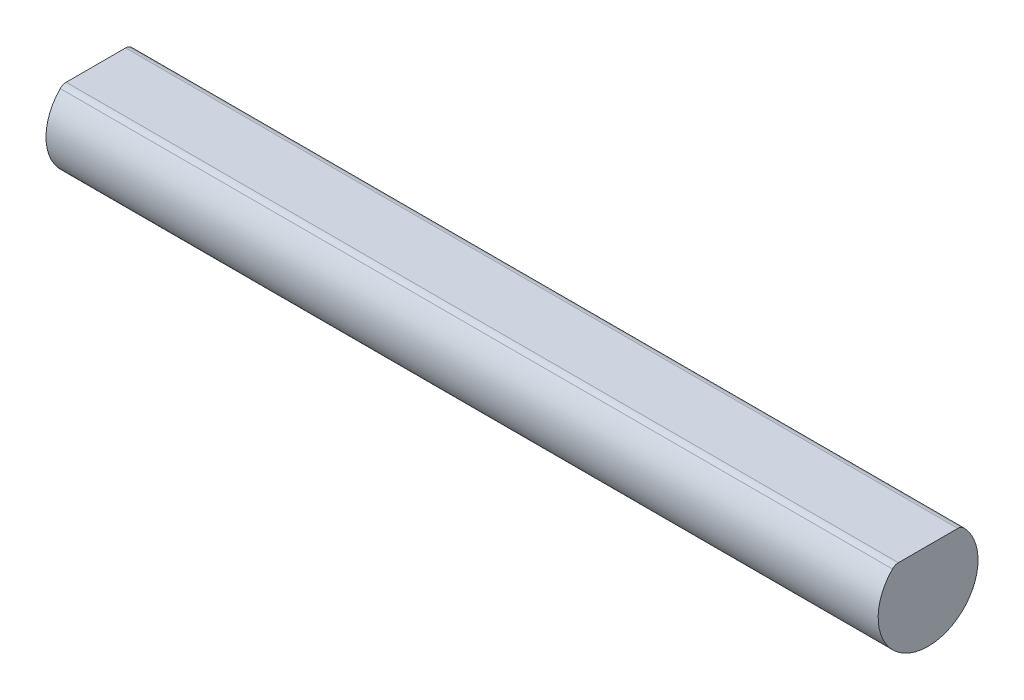
ISO-10303-21;
HEADER;
FILE_DESCRIPTION(('STEP AP214'),'2;1');
FILE_NAME('part.step','',(''),(''),'','','');
FILE_SCHEMA(('AUTOMOTIVE_DESIGN { 1 0 10303 214 1 1 1 1 }'));
ENDSEC;
DATA;
#1=APPLICATION_CONTEXT('core data for automotive mechanical design processes');
#2=APPLICATION_PROTOCOL_DEFINITION('international standard','automotive_design',2000,#1);
#3=PRODUCT_CONTEXT('',#1,'mechanical');
#4=PRODUCT('Part','Part','',(#3));
#5=PRODUCT_RELATED_PRODUCT_CATEGORY('part','',(#4));
#6=PRODUCT_DEFINITION_FORMATION('','',#4);
#7=PRODUCT_DEFINITION_CONTEXT('part definition',#1,'design');
#8=PRODUCT_DEFINITION('design','',#6,#7);
#9=PRODUCT_DEFINITION_SHAPE('','',#8);
#10=(LENGTH_UNIT() NAMED_UNIT(*) SI_UNIT(.MILLI.,.METRE.));
#11=(NAMED_UNIT(*) PLANE_ANGLE_UNIT() SI_UNIT($,.RADIAN.));
#12=(NAMED_UNIT(*) SI_UNIT($,.STERADIAN.) SOLID_ANGLE_UNIT());
#13=UNCERTAINTY_MEASURE_WITH_UNIT(LENGTH_MEASURE(1.E-05),#10,'distance_accuracy_value','');
#14=(GEOMETRIC_REPRESENTATION_CONTEXT(3) GLOBAL_UNCERTAINTY_ASSIGNED_CONTEXT((#13)) GLOBAL_UNIT_ASSIGNED_CONTEXT((#10,
#11,#12)) REPRESENTATION_CONTEXT('',''));
#15=CARTESIAN_POINT('',(0.,0.,0.));
#16=DIRECTION('',(0.,0.,1.));
#17=DIRECTION('',(1.,0.,0.));
#18=AXIS2_PLACEMENT_3D('',#15,#16,#17);
#19=CARTESIAN_POINT('',(100.,0.,0.));
#20=DIRECTION('',(-1.,0.,0.));
#21=DIRECTION('',(0.,0.,1.));
#22=AXIS2_PLACEMENT_3D('',#19,#20,#21);
#23=CYLINDRICAL_SURFACE('',#22,6.);
#24=CARTESIAN_POINT('',(0.,0.,0.));
#25=DIRECTION('',(1.,0.,0.));
#26=DIRECTION('',(0.,0.,-1.));
#27=AXIS2_PLACEMENT_3D('',#24,#25,#26);
#28=CIRCLE('',#27,6.);
#29=CARTESIAN_POINT('',(0.,4.2,4.28485705712571));
#30=VERTEX_POINT('',#29);
#31=CARTESIAN_POINT('',(0.,4.2,-4.28485705712571));
#32=VERTEX_POINT('',#31);
#33=EDGE_CURVE('E106',#30,#32,#28,.T.);
#34=ORIENTED_EDGE('',*,*,#33,.T.);
#35=DIRECTION('',(-1.,0.,0.));
#36=VECTOR('',#35,1.);
#37=CARTESIAN_POINT('',(100.,4.2,-4.28485705712571));
#38=LINE('',#37,#36);
#39=CARTESIAN_POINT('',(100.,4.2,-4.28485705712571));
#40=VERTEX_POINT('',#39);
#41=EDGE_CURVE('E98',#32,#40,#38,.F.);
#42=ORIENTED_EDGE('',*,*,#41,.T.);
#43=CARTESIAN_POINT('',(100.,0.,0.));
#44=DIRECTION('',(1.,0.,0.));
#45=DIRECTION('',(0.,0.,-1.));
#46=AXIS2_PLACEMENT_3D('',#43,#44,#45);
#47=CIRCLE('',#46,6.);
#48=CARTESIAN_POINT('',(100.,4.2,4.28485705712571));
#49=VERTEX_POINT('',#48);
#50=EDGE_CURVE('E90',#49,#40,#47,.T.);
#51=ORIENTED_EDGE('',*,*,#50,.F.);
#52=DIRECTION('',(-1.,0.,0.));
#53=VECTOR('',#52,1.);
#54=CARTESIAN_POINT('',(100.,4.2,4.28485705712571));
#55=LINE('',#54,#53);
#56=EDGE_CURVE('E103',#49,#30,#55,.T.);
#57=ORIENTED_EDGE('',*,*,#56,.T.);
#58=EDGE_LOOP('',(#34,#42,#51,#57));
#59=FACE_BOUND('',#58,.T.);
#60=ADVANCED_FACE('F45',(#59),#23,.T.);
#61=CARTESIAN_POINT('',(100.,0.,0.));
#62=DIRECTION('',(1.,0.,0.));
#63=DIRECTION('',(0.,0.,-1.));
#64=AXIS2_PLACEMENT_3D('',#61,#62,#63);
#65=PLANE('',#64);
#66=ORIENTED_EDGE('',*,*,#50,.T.);
#67=CARTESIAN_POINT('',(100.,3.5,-3.57071421427143));
#68=DIRECTION('',(1.,0.,0.));
#69=DIRECTION('',(0.,0.,-1.));
#70=AXIS2_PLACEMENT_3D('',#67,#68,#69);
#71=CIRCLE('',#70,1.);
#72=CARTESIAN_POINT('',(100.,4.5,-3.57071421427143));
#73=VERTEX_POINT('',#72);
#74=EDGE_CURVE('E97',#40,#73,#71,.T.);
#75=ORIENTED_EDGE('',*,*,#74,.T.);
#76=DIRECTION('',(0.,0.,-1.));
#77=VECTOR('',#76,1.);
#78=CARTESIAN_POINT('',(100.,4.5,0.));
#79=LINE('',#78,#77);
#80=CARTESIAN_POINT('',(100.,4.5,3.57071421427143));
#81=VERTEX_POINT('',#80);
#82=EDGE_CURVE('E91',#81,#73,#79,.T.);
#83=ORIENTED_EDGE('',*,*,#82,.F.);
#84=CARTESIAN_POINT('',(100.,3.5,3.57071421427143));
#85=DIRECTION('',(1.,0.,0.));
#86=DIRECTION('',(0.,0.,-1.));
#87=AXIS2_PLACEMENT_3D('',#84,#85,#86);
#88=CIRCLE('',#87,1.);
#89=EDGE_CURVE('E87',#81,#49,#88,.T.);
#90=ORIENTED_EDGE('',*,*,#89,.T.);
#91=EDGE_LOOP('',(#66,#75,#83,#90));
#92=FACE_BOUND('',#91,.T.);
#93=ADVANCED_FACE('F89',(#92),#65,.T.);
#94=CARTESIAN_POINT('',(0.,0.,0.));
#95=DIRECTION('',(1.,0.,0.));
#96=DIRECTION('',(0.,0.,-1.));
#97=AXIS2_PLACEMENT_3D('',#94,#95,#96);
#98=PLANE('',#97);
#99=DIRECTION('',(0.,0.,-1.));
#100=VECTOR('',#99,1.);
#101=CARTESIAN_POINT('',(0.,4.5,0.));
#102=LINE('',#101,#100);
#103=CARTESIAN_POINT('',(0.,4.5,3.57071421427143));
#104=VERTEX_POINT('',#103);
#105=CARTESIAN_POINT('',(0.,4.5,-3.57071421427143));
#106=VERTEX_POINT('',#105);
#107=EDGE_CURVE('E122',#104,#106,#102,.T.);
#108=ORIENTED_EDGE('',*,*,#107,.T.);
#109=CARTESIAN_POINT('',(0.,3.5,-3.57071421427143));
#110=DIRECTION('',(1.,0.,0.));
#111=DIRECTION('',(0.,0.,-1.));
#112=AXIS2_PLACEMENT_3D('',#109,#110,#111);
#113=CIRCLE('',#112,1.);
#114=EDGE_CURVE('E11',#106,#32,#113,.F.);
#115=ORIENTED_EDGE('',*,*,#114,.T.);
#116=ORIENTED_EDGE('',*,*,#33,.F.);
#117=CARTESIAN_POINT('',(0.,3.5,3.57071421427143));
#118=DIRECTION('',(1.,0.,0.));
#119=DIRECTION('',(0.,0.,-1.));
#120=AXIS2_PLACEMENT_3D('',#117,#118,#119);
#121=CIRCLE('',#120,1.);
#122=EDGE_CURVE('E54',#30,#104,#121,.F.);
#123=ORIENTED_EDGE('',*,*,#122,.T.);
#124=EDGE_LOOP('',(#108,#115,#116,#123));
#125=FACE_BOUND('',#124,.T.);
#126=ADVANCED_FACE('F131',(#125),#98,.F.);
#127=CARTESIAN_POINT('',(0.,4.5,0.));
#128=DIRECTION('',(0.,-1.,0.));
#129=DIRECTION('',(0.,0.,-1.));
#130=AXIS2_PLACEMENT_3D('',#127,#128,#129);
#131=PLANE('',#130);
#132=ORIENTED_EDGE('',*,*,#82,.T.);
#133=DIRECTION('',(-1.,0.,0.));
#134=VECTOR('',#133,1.);
#135=CARTESIAN_POINT('',(0.,4.5,-3.57071421427143));
#136=LINE('',#135,#134);
#137=EDGE_CURVE('E61',#73,#106,#136,.T.);
#138=ORIENTED_EDGE('',*,*,#137,.T.);
#139=ORIENTED_EDGE('',*,*,#107,.F.);
#140=DIRECTION('',(-1.,0.,0.));
#141=VECTOR('',#140,1.);
#142=CARTESIAN_POINT('',(0.,4.5,3.57071421427143));
#143=LINE('',#142,#141);
#144=EDGE_CURVE('E116',#104,#81,#143,.F.);
#145=ORIENTED_EDGE('',*,*,#144,.T.);
#146=EDGE_LOOP('',(#132,#138,#139,#145));
#147=FACE_BOUND('',#146,.T.);
#148=ADVANCED_FACE('F121',(#147),#131,.F.);
#149=CARTESIAN_POINT('',(100.,3.5,-3.57071421427143));
#150=DIRECTION('',(-1.,0.,0.));
#151=DIRECTION('',(0.,0.,1.));
#152=AXIS2_PLACEMENT_3D('',#149,#150,#151);
#153=CYLINDRICAL_SURFACE('',#152,1.);
#154=ORIENTED_EDGE('',*,*,#114,.F.);
#155=ORIENTED_EDGE('',*,*,#137,.F.);
#156=ORIENTED_EDGE('',*,*,#74,.F.);
#157=ORIENTED_EDGE('',*,*,#41,.F.);
#158=EDGE_LOOP('',(#154,#155,#156,#157));
#159=FACE_BOUND('',#158,.T.);
#160=ADVANCED_FACE('F130',(#159),#153,.T.);
#161=CARTESIAN_POINT('',(100.,3.5,3.57071421427143));
#162=DIRECTION('',(-1.,0.,0.));
#163=DIRECTION('',(0.,0.,1.));
#164=AXIS2_PLACEMENT_3D('',#161,#162,#163);
#165=CYLINDRICAL_SURFACE('',#164,1.);
#166=ORIENTED_EDGE('',*,*,#122,.F.);
#167=ORIENTED_EDGE('',*,*,#56,.F.);
#168=ORIENTED_EDGE('',*,*,#89,.F.);
#169=ORIENTED_EDGE('',*,*,#144,.F.);
#170=EDGE_LOOP('',(#166,#167,#168,#169));
#171=FACE_BOUND('',#170,.T.);
#172=ADVANCED_FACE('F47',(#171),#165,.T.);
#173=CLOSED_SHELL('',(#60,#93,#126,#148,#160,#172));
#174=MANIFOLD_SOLID_BREP('B2',#173);
#175=ADVANCED_BREP_SHAPE_REPRESENTATION('',(#18,#174),#14);
#176=SHAPE_DEFINITION_REPRESENTATION(#9,#175);
ENDSEC;
END-ISO-10303-21;
